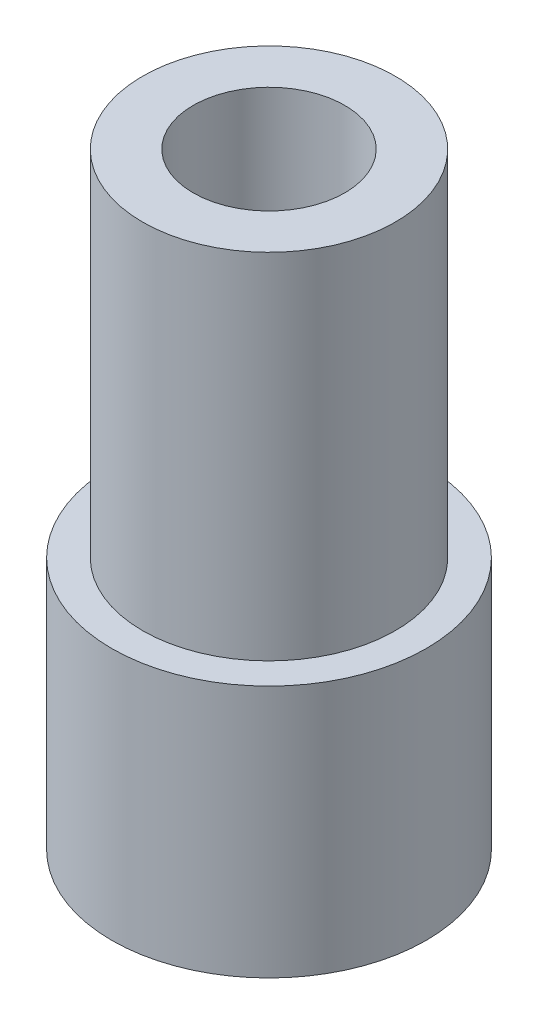
ISO-10303-21;
HEADER;
FILE_DESCRIPTION(('STEP AP214'),'2;1');
FILE_NAME('part.step','',(''),(''),'','','');
FILE_SCHEMA(('AUTOMOTIVE_DESIGN { 1 0 10303 214 1 1 1 1 }'));
ENDSEC;
DATA;
#1=APPLICATION_CONTEXT('core data for automotive mechanical design processes');
#2=APPLICATION_PROTOCOL_DEFINITION('international standard','automotive_design',2000,#1);
#3=PRODUCT_CONTEXT('',#1,'mechanical');
#4=PRODUCT('Part','Part','',(#3));
#5=PRODUCT_RELATED_PRODUCT_CATEGORY('part','',(#4));
#6=PRODUCT_DEFINITION_FORMATION('','',#4);
#7=PRODUCT_DEFINITION_CONTEXT('part definition',#1,'design');
#8=PRODUCT_DEFINITION('design','',#6,#7);
#9=PRODUCT_DEFINITION_SHAPE('','',#8);
#10=(LENGTH_UNIT() NAMED_UNIT(*) SI_UNIT(.MILLI.,.METRE.));
#11=(NAMED_UNIT(*) PLANE_ANGLE_UNIT() SI_UNIT($,.RADIAN.));
#12=(NAMED_UNIT(*) SI_UNIT($,.STERADIAN.) SOLID_ANGLE_UNIT());
#13=UNCERTAINTY_MEASURE_WITH_UNIT(LENGTH_MEASURE(1.E-05),#10,'distance_accuracy_value','');
#14=(GEOMETRIC_REPRESENTATION_CONTEXT(3) GLOBAL_UNCERTAINTY_ASSIGNED_CONTEXT((#13)) GLOBAL_UNIT_ASSIGNED_CONTEXT((#10,
#11,#12)) REPRESENTATION_CONTEXT('',''));
#15=CARTESIAN_POINT('',(0.,0.,0.));
#16=DIRECTION('',(0.,0.,1.));
#17=DIRECTION('',(1.,0.,0.));
#18=AXIS2_PLACEMENT_3D('',#15,#16,#17);
#19=CARTESIAN_POINT('',(2.5,3.5,0.));
#20=DIRECTION('',(0.,-1.,0.));
#21=DIRECTION('',(0.,0.,-1.));
#22=AXIS2_PLACEMENT_3D('',#19,#20,#21);
#23=PLANE('',#22);
#24=CARTESIAN_POINT('',(0.,3.5,0.));
#25=DIRECTION('',(0.,1.,0.));
#26=DIRECTION('',(0.,0.,1.));
#27=AXIS2_PLACEMENT_3D('',#24,#25,#26);
#28=CIRCLE('',#27,1.5);
#29=CARTESIAN_POINT('',(0.,3.5,1.5));
#30=VERTEX_POINT('',#29);
#31=EDGE_CURVE('E12',#30,#30,#28,.T.);
#32=ORIENTED_EDGE('',*,*,#31,.F.);
#33=EDGE_LOOP('',(#32));
#34=FACE_BOUND('',#33,.T.);
#35=CARTESIAN_POINT('',(0.,3.5,0.));
#36=DIRECTION('',(0.,1.,0.));
#37=DIRECTION('',(0.,0.,1.));
#38=AXIS2_PLACEMENT_3D('',#35,#36,#37);
#39=CIRCLE('',#38,2.5);
#40=CARTESIAN_POINT('',(0.,3.5,2.5));
#41=VERTEX_POINT('',#40);
#42=EDGE_CURVE('E67',#41,#41,#39,.T.);
#43=ORIENTED_EDGE('',*,*,#42,.T.);
#44=EDGE_LOOP('',(#43));
#45=FACE_BOUND('',#44,.T.);
#46=ADVANCED_FACE('F45',(#34,#45),#23,.F.);
#47=CARTESIAN_POINT('',(0.,8.62657632471953,0.));
#48=DIRECTION('',(0.,1.,0.));
#49=DIRECTION('',(0.,0.,1.));
#50=AXIS2_PLACEMENT_3D('',#47,#48,#49);
#51=CYLINDRICAL_SURFACE('',#50,1.5);
#52=CARTESIAN_POINT('',(0.,-8.5,0.));
#53=DIRECTION('',(0.,1.,0.));
#54=DIRECTION('',(0.,0.,1.));
#55=AXIS2_PLACEMENT_3D('',#52,#53,#54);
#56=CIRCLE('',#55,1.5);
#57=CARTESIAN_POINT('',(0.,-8.5,1.5));
#58=VERTEX_POINT('',#57);
#59=EDGE_CURVE('E51',#58,#58,#56,.T.);
#60=ORIENTED_EDGE('',*,*,#59,.F.);
#61=EDGE_LOOP('',(#60));
#62=FACE_BOUND('',#61,.T.);
#63=ORIENTED_EDGE('',*,*,#31,.T.);
#64=EDGE_LOOP('',(#63));
#65=FACE_BOUND('',#64,.T.);
#66=ADVANCED_FACE('F92',(#62,#65),#51,.F.);
#67=CARTESIAN_POINT('',(1.5,-8.5,0.));
#68=DIRECTION('',(0.,1.,0.));
#69=DIRECTION('',(0.,0.,1.));
#70=AXIS2_PLACEMENT_3D('',#67,#68,#69);
#71=PLANE('',#70);
#72=CARTESIAN_POINT('',(0.,-8.5,0.));
#73=DIRECTION('',(0.,1.,0.));
#74=DIRECTION('',(0.,0.,1.));
#75=AXIS2_PLACEMENT_3D('',#72,#73,#74);
#76=CIRCLE('',#75,3.11111111111111);
#77=CARTESIAN_POINT('',(0.,-8.5,3.11111111111111));
#78=VERTEX_POINT('',#77);
#79=EDGE_CURVE('E55',#78,#78,#76,.T.);
#80=ORIENTED_EDGE('',*,*,#79,.F.);
#81=EDGE_LOOP('',(#80));
#82=FACE_BOUND('',#81,.T.);
#83=ORIENTED_EDGE('',*,*,#59,.T.);
#84=EDGE_LOOP('',(#83));
#85=FACE_BOUND('',#84,.T.);
#86=ADVANCED_FACE('F87',(#82,#85),#71,.F.);
#87=CARTESIAN_POINT('',(0.,8.62657632471953,0.));
#88=DIRECTION('',(0.,1.,0.));
#89=DIRECTION('',(0.,0.,1.));
#90=AXIS2_PLACEMENT_3D('',#87,#88,#89);
#91=CYLINDRICAL_SURFACE('',#90,3.11111111111111);
#92=CARTESIAN_POINT('',(0.,-3.5,0.));
#93=DIRECTION('',(0.,1.,0.));
#94=DIRECTION('',(0.,0.,1.));
#95=AXIS2_PLACEMENT_3D('',#92,#93,#94);
#96=CIRCLE('',#95,3.11111111111111);
#97=CARTESIAN_POINT('',(0.,-3.5,3.11111111111111));
#98=VERTEX_POINT('',#97);
#99=EDGE_CURVE('E59',#98,#98,#96,.T.);
#100=ORIENTED_EDGE('',*,*,#99,.F.);
#101=EDGE_LOOP('',(#100));
#102=FACE_BOUND('',#101,.T.);
#103=ORIENTED_EDGE('',*,*,#79,.T.);
#104=EDGE_LOOP('',(#103));
#105=FACE_BOUND('',#104,.T.);
#106=ADVANCED_FACE('F81',(#102,#105),#91,.T.);
#107=CARTESIAN_POINT('',(3.11111111111111,-3.5,0.));
#108=DIRECTION('',(0.,-1.,0.));
#109=DIRECTION('',(0.,0.,-1.));
#110=AXIS2_PLACEMENT_3D('',#107,#108,#109);
#111=PLANE('',#110);
#112=CARTESIAN_POINT('',(0.,-3.5,0.));
#113=DIRECTION('',(0.,1.,0.));
#114=DIRECTION('',(0.,0.,1.));
#115=AXIS2_PLACEMENT_3D('',#112,#113,#114);
#116=CIRCLE('',#115,2.5);
#117=CARTESIAN_POINT('',(0.,-3.5,2.5));
#118=VERTEX_POINT('',#117);
#119=EDGE_CURVE('E64',#118,#118,#116,.T.);
#120=ORIENTED_EDGE('',*,*,#119,.F.);
#121=EDGE_LOOP('',(#120));
#122=FACE_BOUND('',#121,.T.);
#123=ORIENTED_EDGE('',*,*,#99,.T.);
#124=EDGE_LOOP('',(#123));
#125=FACE_BOUND('',#124,.T.);
#126=ADVANCED_FACE('F75',(#122,#125),#111,.F.);
#127=CARTESIAN_POINT('',(0.,8.62657632471953,0.));
#128=DIRECTION('',(0.,1.,0.));
#129=DIRECTION('',(0.,0.,1.));
#130=AXIS2_PLACEMENT_3D('',#127,#128,#129);
#131=CYLINDRICAL_SURFACE('',#130,2.5);
#132=ORIENTED_EDGE('',*,*,#42,.F.);
#133=EDGE_LOOP('',(#132));
#134=FACE_BOUND('',#133,.T.);
#135=ORIENTED_EDGE('',*,*,#119,.T.);
#136=EDGE_LOOP('',(#135));
#137=FACE_BOUND('',#136,.T.);
#138=ADVANCED_FACE('F72',(#134,#137),#131,.T.);
#139=CLOSED_SHELL('',(#46,#66,#86,#106,#126,#138));
#140=MANIFOLD_SOLID_BREP('B2',#139);
#141=ADVANCED_BREP_SHAPE_REPRESENTATION('',(#18,#140),#14);
#142=SHAPE_DEFINITION_REPRESENTATION(#9,#141);
ENDSEC;
END-ISO-10303-21;
